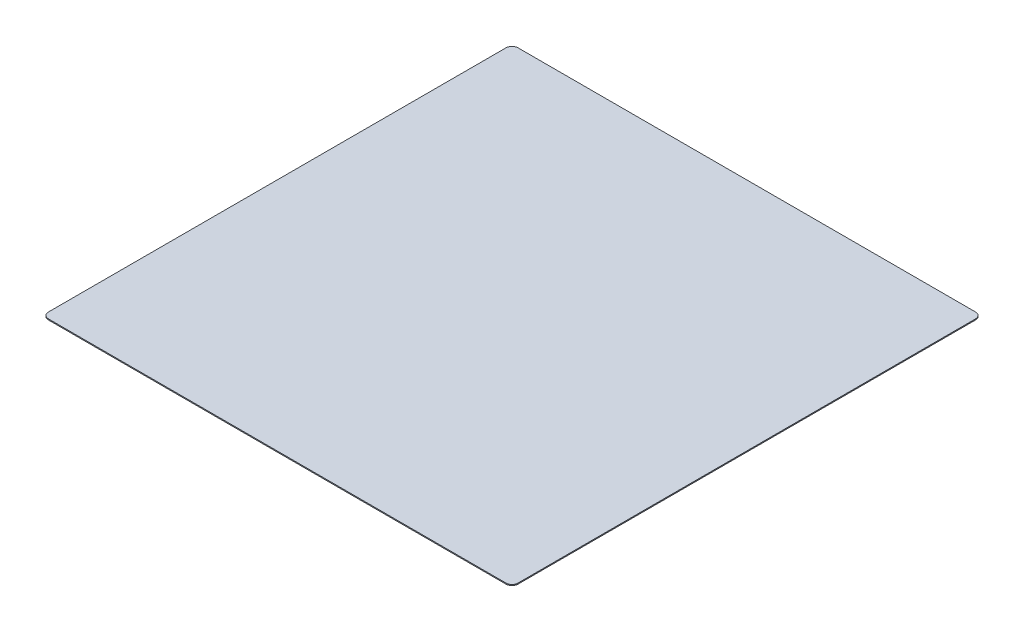
ISO-10303-21;
HEADER;
FILE_DESCRIPTION(('STEP AP214'),'2;1');
FILE_NAME('part.step','',(''),(''),'','','');
FILE_SCHEMA(('AUTOMOTIVE_DESIGN { 1 0 10303 214 1 1 1 1 }'));
ENDSEC;
DATA;
#1=APPLICATION_CONTEXT('core data for automotive mechanical design processes');
#2=APPLICATION_PROTOCOL_DEFINITION('international standard','automotive_design',2000,#1);
#3=PRODUCT_CONTEXT('',#1,'mechanical');
#4=PRODUCT('Part','Part','',(#3));
#5=PRODUCT_RELATED_PRODUCT_CATEGORY('part','',(#4));
#6=PRODUCT_DEFINITION_FORMATION('','',#4);
#7=PRODUCT_DEFINITION_CONTEXT('part definition',#1,'design');
#8=PRODUCT_DEFINITION('design','',#6,#7);
#9=PRODUCT_DEFINITION_SHAPE('','',#8);
#10=(LENGTH_UNIT() NAMED_UNIT(*) SI_UNIT(.MILLI.,.METRE.));
#11=(NAMED_UNIT(*) PLANE_ANGLE_UNIT() SI_UNIT($,.RADIAN.));
#12=(NAMED_UNIT(*) SI_UNIT($,.STERADIAN.) SOLID_ANGLE_UNIT());
#13=UNCERTAINTY_MEASURE_WITH_UNIT(LENGTH_MEASURE(1.E-05),#10,'distance_accuracy_value','');
#14=(GEOMETRIC_REPRESENTATION_CONTEXT(3) GLOBAL_UNCERTAINTY_ASSIGNED_CONTEXT((#13)) GLOBAL_UNIT_ASSIGNED_CONTEXT((#10,
#11,#12)) REPRESENTATION_CONTEXT('',''));
#15=CARTESIAN_POINT('',(0.,0.,0.));
#16=DIRECTION('',(0.,0.,1.));
#17=DIRECTION('',(1.,0.,0.));
#18=AXIS2_PLACEMENT_3D('',#15,#16,#17);
#19=CARTESIAN_POINT('',(-114.5,0.5,114.5));
#20=DIRECTION('',(0.,-1.,0.));
#21=DIRECTION('',(0.,0.,-1.));
#22=AXIS2_PLACEMENT_3D('',#19,#20,#21);
#23=CYLINDRICAL_SURFACE('',#22,3.);
#24=CARTESIAN_POINT('',(-114.5,0.,114.5));
#25=DIRECTION('',(0.,1.,0.));
#26=DIRECTION('',(0.,0.,1.));
#27=AXIS2_PLACEMENT_3D('',#24,#25,#26);
#28=CIRCLE('',#27,3.);
#29=CARTESIAN_POINT('',(-117.5,0.,114.5));
#30=VERTEX_POINT('',#29);
#31=CARTESIAN_POINT('',(-114.5,0.,117.5));
#32=VERTEX_POINT('',#31);
#33=EDGE_CURVE('E129',#30,#32,#28,.T.);
#34=ORIENTED_EDGE('',*,*,#33,.T.);
#35=DIRECTION('',(0.,-1.,0.));
#36=VECTOR('',#35,1.);
#37=CARTESIAN_POINT('',(-114.5,0.5,117.5));
#38=LINE('',#37,#36);
#39=CARTESIAN_POINT('',(-114.5,0.5,117.5));
#40=VERTEX_POINT('',#39);
#41=EDGE_CURVE('E11',#40,#32,#38,.T.);
#42=ORIENTED_EDGE('',*,*,#41,.F.);
#43=CARTESIAN_POINT('',(-114.5,0.5,114.5));
#44=DIRECTION('',(0.,1.,0.));
#45=DIRECTION('',(0.,0.,1.));
#46=AXIS2_PLACEMENT_3D('',#43,#44,#45);
#47=CIRCLE('',#46,3.);
#48=CARTESIAN_POINT('',(-117.5,0.5,114.5));
#49=VERTEX_POINT('',#48);
#50=EDGE_CURVE('E143',#49,#40,#47,.T.);
#51=ORIENTED_EDGE('',*,*,#50,.F.);
#52=DIRECTION('',(0.,-1.,0.));
#53=VECTOR('',#52,1.);
#54=CARTESIAN_POINT('',(-117.5,0.5,114.5));
#55=LINE('',#54,#53);
#56=EDGE_CURVE('E125',#49,#30,#55,.T.);
#57=ORIENTED_EDGE('',*,*,#56,.T.);
#58=EDGE_LOOP('',(#34,#42,#51,#57));
#59=FACE_BOUND('',#58,.T.);
#60=ADVANCED_FACE('F33',(#59),#23,.T.);
#61=CARTESIAN_POINT('',(-114.5,0.5,117.5));
#62=DIRECTION('',(0.,0.,-1.));
#63=DIRECTION('',(-1.,0.,0.));
#64=AXIS2_PLACEMENT_3D('',#61,#62,#63);
#65=PLANE('',#64);
#66=DIRECTION('',(1.,0.,0.));
#67=VECTOR('',#66,1.);
#68=CARTESIAN_POINT('',(-114.5,0.,117.5));
#69=LINE('',#68,#67);
#70=CARTESIAN_POINT('',(114.5,0.,117.5));
#71=VERTEX_POINT('',#70);
#72=EDGE_CURVE('E132',#32,#71,#69,.T.);
#73=ORIENTED_EDGE('',*,*,#72,.T.);
#74=DIRECTION('',(0.,-1.,0.));
#75=VECTOR('',#74,1.);
#76=CARTESIAN_POINT('',(114.5,0.5,117.5));
#77=LINE('',#76,#75);
#78=CARTESIAN_POINT('',(114.5,0.5,117.5));
#79=VERTEX_POINT('',#78);
#80=EDGE_CURVE('E41',#79,#71,#77,.T.);
#81=ORIENTED_EDGE('',*,*,#80,.F.);
#82=DIRECTION('',(1.,0.,0.));
#83=VECTOR('',#82,1.);
#84=CARTESIAN_POINT('',(-114.5,0.5,117.5));
#85=LINE('',#84,#83);
#86=EDGE_CURVE('E92',#40,#79,#85,.T.);
#87=ORIENTED_EDGE('',*,*,#86,.F.);
#88=ORIENTED_EDGE('',*,*,#41,.T.);
#89=EDGE_LOOP('',(#73,#81,#87,#88));
#90=FACE_BOUND('',#89,.T.);
#91=ADVANCED_FACE('F178',(#90),#65,.F.);
#92=CARTESIAN_POINT('',(114.5,0.5,114.5));
#93=DIRECTION('',(0.,-1.,0.));
#94=DIRECTION('',(0.,0.,-1.));
#95=AXIS2_PLACEMENT_3D('',#92,#93,#94);
#96=CYLINDRICAL_SURFACE('',#95,3.);
#97=CARTESIAN_POINT('',(114.5,0.,114.5));
#98=DIRECTION('',(0.,1.,0.));
#99=DIRECTION('',(0.,0.,1.));
#100=AXIS2_PLACEMENT_3D('',#97,#98,#99);
#101=CIRCLE('',#100,3.);
#102=CARTESIAN_POINT('',(117.5,0.,114.5));
#103=VERTEX_POINT('',#102);
#104=EDGE_CURVE('E134',#71,#103,#101,.T.);
#105=ORIENTED_EDGE('',*,*,#104,.T.);
#106=DIRECTION('',(0.,-1.,0.));
#107=VECTOR('',#106,1.);
#108=CARTESIAN_POINT('',(117.5,0.5,114.5));
#109=LINE('',#108,#107);
#110=CARTESIAN_POINT('',(117.5,0.5,114.5));
#111=VERTEX_POINT('',#110);
#112=EDGE_CURVE('E150',#111,#103,#109,.T.);
#113=ORIENTED_EDGE('',*,*,#112,.F.);
#114=CARTESIAN_POINT('',(114.5,0.5,114.5));
#115=DIRECTION('',(0.,1.,0.));
#116=DIRECTION('',(0.,0.,1.));
#117=AXIS2_PLACEMENT_3D('',#114,#115,#116);
#118=CIRCLE('',#117,3.);
#119=EDGE_CURVE('E158',#79,#111,#118,.T.);
#120=ORIENTED_EDGE('',*,*,#119,.F.);
#121=ORIENTED_EDGE('',*,*,#80,.T.);
#122=EDGE_LOOP('',(#105,#113,#120,#121));
#123=FACE_BOUND('',#122,.T.);
#124=ADVANCED_FACE('F156',(#123),#96,.T.);
#125=CARTESIAN_POINT('',(117.5,0.5,114.5));
#126=DIRECTION('',(-1.,0.,0.));
#127=DIRECTION('',(0.,0.,1.));
#128=AXIS2_PLACEMENT_3D('',#125,#126,#127);
#129=PLANE('',#128);
#130=DIRECTION('',(0.,0.,-1.));
#131=VECTOR('',#130,1.);
#132=CARTESIAN_POINT('',(117.5,0.,114.5));
#133=LINE('',#132,#131);
#134=CARTESIAN_POINT('',(117.5,0.,-114.5));
#135=VERTEX_POINT('',#134);
#136=EDGE_CURVE('E136',#103,#135,#133,.T.);
#137=ORIENTED_EDGE('',*,*,#136,.T.);
#138=DIRECTION('',(0.,-1.,0.));
#139=VECTOR('',#138,1.);
#140=CARTESIAN_POINT('',(117.5,0.5,-114.5));
#141=LINE('',#140,#139);
#142=CARTESIAN_POINT('',(117.5,0.5,-114.5));
#143=VERTEX_POINT('',#142);
#144=EDGE_CURVE('E147',#143,#135,#141,.T.);
#145=ORIENTED_EDGE('',*,*,#144,.F.);
#146=DIRECTION('',(0.,0.,-1.));
#147=VECTOR('',#146,1.);
#148=CARTESIAN_POINT('',(117.5,0.5,114.5));
#149=LINE('',#148,#147);
#150=EDGE_CURVE('E170',#111,#143,#149,.T.);
#151=ORIENTED_EDGE('',*,*,#150,.F.);
#152=ORIENTED_EDGE('',*,*,#112,.T.);
#153=EDGE_LOOP('',(#137,#145,#151,#152));
#154=FACE_BOUND('',#153,.T.);
#155=ADVANCED_FACE('F166',(#154),#129,.F.);
#156=CARTESIAN_POINT('',(114.5,0.5,-114.5));
#157=DIRECTION('',(0.,-1.,0.));
#158=DIRECTION('',(0.,0.,-1.));
#159=AXIS2_PLACEMENT_3D('',#156,#157,#158);
#160=CYLINDRICAL_SURFACE('',#159,3.);
#161=CARTESIAN_POINT('',(114.5,0.,-114.5));
#162=DIRECTION('',(0.,1.,0.));
#163=DIRECTION('',(0.,0.,1.));
#164=AXIS2_PLACEMENT_3D('',#161,#162,#163);
#165=CIRCLE('',#164,3.);
#166=CARTESIAN_POINT('',(114.5,0.,-117.5));
#167=VERTEX_POINT('',#166);
#168=EDGE_CURVE('E138',#135,#167,#165,.T.);
#169=ORIENTED_EDGE('',*,*,#168,.T.);
#170=DIRECTION('',(0.,-1.,0.));
#171=VECTOR('',#170,1.);
#172=CARTESIAN_POINT('',(114.5,0.5,-117.5));
#173=LINE('',#172,#171);
#174=CARTESIAN_POINT('',(114.5,0.5,-117.5));
#175=VERTEX_POINT('',#174);
#176=EDGE_CURVE('E120',#175,#167,#173,.T.);
#177=ORIENTED_EDGE('',*,*,#176,.F.);
#178=CARTESIAN_POINT('',(114.5,0.5,-114.5));
#179=DIRECTION('',(0.,1.,0.));
#180=DIRECTION('',(0.,0.,1.));
#181=AXIS2_PLACEMENT_3D('',#178,#179,#180);
#182=CIRCLE('',#181,3.);
#183=EDGE_CURVE('E111',#143,#175,#182,.T.);
#184=ORIENTED_EDGE('',*,*,#183,.F.);
#185=ORIENTED_EDGE('',*,*,#144,.T.);
#186=EDGE_LOOP('',(#169,#177,#184,#185));
#187=FACE_BOUND('',#186,.T.);
#188=ADVANCED_FACE('F169',(#187),#160,.T.);
#189=CARTESIAN_POINT('',(114.5,0.5,-117.5));
#190=DIRECTION('',(0.,0.,1.));
#191=DIRECTION('',(1.,0.,0.));
#192=AXIS2_PLACEMENT_3D('',#189,#190,#191);
#193=PLANE('',#192);
#194=DIRECTION('',(-1.,0.,0.));
#195=VECTOR('',#194,1.);
#196=CARTESIAN_POINT('',(114.5,0.,-117.5));
#197=LINE('',#196,#195);
#198=CARTESIAN_POINT('',(-114.5,0.,-117.5));
#199=VERTEX_POINT('',#198);
#200=EDGE_CURVE('E119',#167,#199,#197,.T.);
#201=ORIENTED_EDGE('',*,*,#200,.T.);
#202=DIRECTION('',(0.,-1.,0.));
#203=VECTOR('',#202,1.);
#204=CARTESIAN_POINT('',(-114.5,0.5,-117.5));
#205=LINE('',#204,#203);
#206=CARTESIAN_POINT('',(-114.5,0.5,-117.5));
#207=VERTEX_POINT('',#206);
#208=EDGE_CURVE('E116',#207,#199,#205,.T.);
#209=ORIENTED_EDGE('',*,*,#208,.F.);
#210=DIRECTION('',(-1.,0.,0.));
#211=VECTOR('',#210,1.);
#212=CARTESIAN_POINT('',(114.5,0.5,-117.5));
#213=LINE('',#212,#211);
#214=EDGE_CURVE('E105',#175,#207,#213,.T.);
#215=ORIENTED_EDGE('',*,*,#214,.F.);
#216=ORIENTED_EDGE('',*,*,#176,.T.);
#217=EDGE_LOOP('',(#201,#209,#215,#216));
#218=FACE_BOUND('',#217,.T.);
#219=ADVANCED_FACE('F117',(#218),#193,.F.);
#220=CARTESIAN_POINT('',(-114.5,0.5,-114.5));
#221=DIRECTION('',(0.,-1.,0.));
#222=DIRECTION('',(0.,0.,-1.));
#223=AXIS2_PLACEMENT_3D('',#220,#221,#222);
#224=CYLINDRICAL_SURFACE('',#223,3.);
#225=CARTESIAN_POINT('',(-114.5,0.,-114.5));
#226=DIRECTION('',(0.,1.,0.));
#227=DIRECTION('',(0.,0.,1.));
#228=AXIS2_PLACEMENT_3D('',#225,#226,#227);
#229=CIRCLE('',#228,3.);
#230=CARTESIAN_POINT('',(-117.5,0.,-114.5));
#231=VERTEX_POINT('',#230);
#232=EDGE_CURVE('E78',#199,#231,#229,.T.);
#233=ORIENTED_EDGE('',*,*,#232,.T.);
#234=DIRECTION('',(0.,-1.,0.));
#235=VECTOR('',#234,1.);
#236=CARTESIAN_POINT('',(-117.5,0.5,-114.5));
#237=LINE('',#236,#235);
#238=CARTESIAN_POINT('',(-117.5,0.5,-114.5));
#239=VERTEX_POINT('',#238);
#240=EDGE_CURVE('E121',#239,#231,#237,.T.);
#241=ORIENTED_EDGE('',*,*,#240,.F.);
#242=CARTESIAN_POINT('',(-114.5,0.5,-114.5));
#243=DIRECTION('',(0.,1.,0.));
#244=DIRECTION('',(0.,0.,1.));
#245=AXIS2_PLACEMENT_3D('',#242,#243,#244);
#246=CIRCLE('',#245,3.);
#247=EDGE_CURVE('E109',#207,#239,#246,.T.);
#248=ORIENTED_EDGE('',*,*,#247,.F.);
#249=ORIENTED_EDGE('',*,*,#208,.T.);
#250=EDGE_LOOP('',(#233,#241,#248,#249));
#251=FACE_BOUND('',#250,.T.);
#252=ADVANCED_FACE('F123',(#251),#224,.T.);
#253=CARTESIAN_POINT('',(-117.5,0.5,-114.5));
#254=DIRECTION('',(1.,0.,0.));
#255=DIRECTION('',(0.,0.,-1.));
#256=AXIS2_PLACEMENT_3D('',#253,#254,#255);
#257=PLANE('',#256);
#258=DIRECTION('',(0.,0.,1.));
#259=VECTOR('',#258,1.);
#260=CARTESIAN_POINT('',(-117.5,0.,-114.5));
#261=LINE('',#260,#259);
#262=EDGE_CURVE('E84',#231,#30,#261,.T.);
#263=ORIENTED_EDGE('',*,*,#262,.T.);
#264=ORIENTED_EDGE('',*,*,#56,.F.);
#265=DIRECTION('',(0.,0.,1.));
#266=VECTOR('',#265,1.);
#267=CARTESIAN_POINT('',(-117.5,0.5,-114.5));
#268=LINE('',#267,#266);
#269=EDGE_CURVE('E49',#239,#49,#268,.T.);
#270=ORIENTED_EDGE('',*,*,#269,.F.);
#271=ORIENTED_EDGE('',*,*,#240,.T.);
#272=EDGE_LOOP('',(#263,#264,#270,#271));
#273=FACE_BOUND('',#272,.T.);
#274=ADVANCED_FACE('F194',(#273),#257,.F.);
#275=CARTESIAN_POINT('',(-114.5,0.5,114.5));
#276=DIRECTION('',(0.,1.,0.));
#277=DIRECTION('',(0.,0.,1.));
#278=AXIS2_PLACEMENT_3D('',#275,#276,#277);
#279=PLANE('',#278);
#280=ORIENTED_EDGE('',*,*,#50,.T.);
#281=ORIENTED_EDGE('',*,*,#86,.T.);
#282=ORIENTED_EDGE('',*,*,#119,.T.);
#283=ORIENTED_EDGE('',*,*,#150,.T.);
#284=ORIENTED_EDGE('',*,*,#183,.T.);
#285=ORIENTED_EDGE('',*,*,#214,.T.);
#286=ORIENTED_EDGE('',*,*,#247,.T.);
#287=ORIENTED_EDGE('',*,*,#269,.T.);
#288=EDGE_LOOP('',(#280,#281,#282,#283,#284,#285,#286,#287));
#289=FACE_BOUND('',#288,.T.);
#290=ADVANCED_FACE('F107',(#289),#279,.T.);
#291=CARTESIAN_POINT('',(-114.5,0.,114.5));
#292=DIRECTION('',(0.,1.,0.));
#293=DIRECTION('',(0.,0.,1.));
#294=AXIS2_PLACEMENT_3D('',#291,#292,#293);
#295=PLANE('',#294);
#296=ORIENTED_EDGE('',*,*,#33,.F.);
#297=ORIENTED_EDGE('',*,*,#262,.F.);
#298=ORIENTED_EDGE('',*,*,#232,.F.);
#299=ORIENTED_EDGE('',*,*,#200,.F.);
#300=ORIENTED_EDGE('',*,*,#168,.F.);
#301=ORIENTED_EDGE('',*,*,#136,.F.);
#302=ORIENTED_EDGE('',*,*,#104,.F.);
#303=ORIENTED_EDGE('',*,*,#72,.F.);
#304=EDGE_LOOP('',(#296,#297,#298,#299,#300,#301,#302,#303));
#305=FACE_BOUND('',#304,.T.);
#306=ADVANCED_FACE('F162',(#305),#295,.F.);
#307=CLOSED_SHELL('',(#60,#91,#124,#155,#188,#219,#252,#274,#290,#306));
#308=MANIFOLD_SOLID_BREP('B2',#307);
#309=ADVANCED_BREP_SHAPE_REPRESENTATION('',(#18,#308),#14);
#310=SHAPE_DEFINITION_REPRESENTATION(#9,#309);
ENDSEC;
END-ISO-10303-21;
